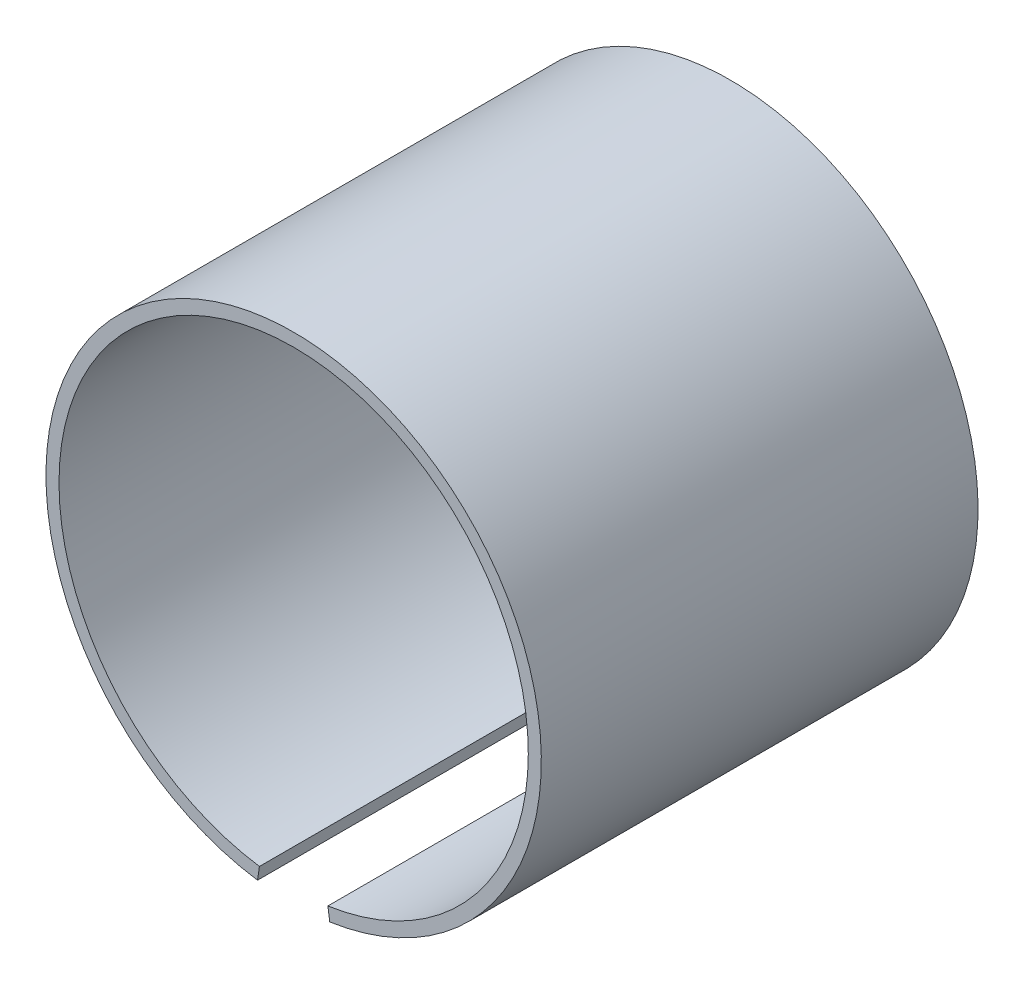
ISO-10303-21;
HEADER;
FILE_DESCRIPTION(('STEP AP214'),'2;1');
FILE_NAME('part.step','',(''),(''),'','','');
FILE_SCHEMA(('AUTOMOTIVE_DESIGN { 1 0 10303 214 1 1 1 1 }'));
ENDSEC;
DATA;
#1=APPLICATION_CONTEXT('core data for automotive mechanical design processes');
#2=APPLICATION_PROTOCOL_DEFINITION('international standard','automotive_design',2000,#1);
#3=PRODUCT_CONTEXT('',#1,'mechanical');
#4=PRODUCT('Part','Part','',(#3));
#5=PRODUCT_RELATED_PRODUCT_CATEGORY('part','',(#4));
#6=PRODUCT_DEFINITION_FORMATION('','',#4);
#7=PRODUCT_DEFINITION_CONTEXT('part definition',#1,'design');
#8=PRODUCT_DEFINITION('design','',#6,#7);
#9=PRODUCT_DEFINITION_SHAPE('','',#8);
#10=(LENGTH_UNIT() NAMED_UNIT(*) SI_UNIT(.MILLI.,.METRE.));
#11=(NAMED_UNIT(*) PLANE_ANGLE_UNIT() SI_UNIT($,.RADIAN.));
#12=(NAMED_UNIT(*) SI_UNIT($,.STERADIAN.) SOLID_ANGLE_UNIT());
#13=UNCERTAINTY_MEASURE_WITH_UNIT(LENGTH_MEASURE(1.E-05),#10,'distance_accuracy_value','');
#14=(GEOMETRIC_REPRESENTATION_CONTEXT(3) GLOBAL_UNCERTAINTY_ASSIGNED_CONTEXT((#13)) GLOBAL_UNIT_ASSIGNED_CONTEXT((#10,
#11,#12)) REPRESENTATION_CONTEXT('',''));
#15=CARTESIAN_POINT('',(0.,0.,0.));
#16=DIRECTION('',(0.,0.,1.));
#17=DIRECTION('',(1.,0.,0.));
#18=AXIS2_PLACEMENT_3D('',#15,#16,#17);
#19=CARTESIAN_POINT('',(-2.625,-17.8075651058757,-16.75));
#20=DIRECTION('',(-0.989309172548646,0.14583333333334,0.));
#21=DIRECTION('',(-0.14583333333334,-0.989309172548646,0.));
#22=AXIS2_PLACEMENT_3D('',#19,#20,#21);
#23=PLANE('',#22);
#24=DIRECTION('',(0.,0.,1.));
#25=VECTOR('',#24,1.);
#26=CARTESIAN_POINT('',(-2.77083333333334,-18.7968742784243,-16.75));
#27=LINE('',#26,#25);
#28=CARTESIAN_POINT('',(-2.77083333333334,-18.7968742784243,-16.75));
#29=VERTEX_POINT('',#28);
#30=CARTESIAN_POINT('',(-2.77083333333334,-18.7968742784243,16.75));
#31=VERTEX_POINT('',#30);
#32=EDGE_CURVE('E64',#29,#31,#27,.T.);
#33=ORIENTED_EDGE('',*,*,#32,.F.);
#34=DIRECTION('',(-0.14583333333334,-0.989309172548646,0.));
#35=VECTOR('',#34,1.);
#36=CARTESIAN_POINT('',(-2.625,-17.8075651058757,-16.75));
#37=LINE('',#36,#35);
#38=CARTESIAN_POINT('',(-2.625,-17.8075651058757,-16.75));
#39=VERTEX_POINT('',#38);
#40=EDGE_CURVE('E60',#39,#29,#37,.T.);
#41=ORIENTED_EDGE('',*,*,#40,.F.);
#42=DIRECTION('',(0.,0.,1.));
#43=VECTOR('',#42,1.);
#44=CARTESIAN_POINT('',(-2.625,-17.8075651058757,-16.75));
#45=LINE('',#44,#43);
#46=CARTESIAN_POINT('',(-2.625,-17.8075651058757,16.75));
#47=VERTEX_POINT('',#46);
#48=EDGE_CURVE('E67',#39,#47,#45,.T.);
#49=ORIENTED_EDGE('',*,*,#48,.T.);
#50=DIRECTION('',(-0.14583333333334,-0.989309172548646,0.));
#51=VECTOR('',#50,1.);
#52=CARTESIAN_POINT('',(-2.625,-17.8075651058757,16.75));
#53=LINE('',#52,#51);
#54=EDGE_CURVE('E73',#31,#47,#53,.F.);
#55=ORIENTED_EDGE('',*,*,#54,.F.);
#56=EDGE_LOOP('',(#33,#41,#49,#55));
#57=FACE_BOUND('',#56,.T.);
#58=ADVANCED_FACE('F17',(#57),#23,.F.);
#59=CARTESIAN_POINT('',(0.,0.,-16.75));
#60=DIRECTION('',(0.,0.,1.));
#61=DIRECTION('',(1.,0.,0.));
#62=AXIS2_PLACEMENT_3D('',#59,#60,#61);
#63=CYLINDRICAL_SURFACE('',#62,18.);
#64=ORIENTED_EDGE('',*,*,#48,.F.);
#65=CARTESIAN_POINT('',(0.,0.,-16.75));
#66=DIRECTION('',(0.,0.,1.));
#67=DIRECTION('',(1.,0.,0.));
#68=AXIS2_PLACEMENT_3D('',#65,#66,#67);
#69=CIRCLE('',#68,18.);
#70=CARTESIAN_POINT('',(2.625,-17.8075651058757,-16.75));
#71=VERTEX_POINT('',#70);
#72=EDGE_CURVE('E20',#71,#39,#69,.T.);
#73=ORIENTED_EDGE('',*,*,#72,.F.);
#74=DIRECTION('',(0.,0.,1.));
#75=VECTOR('',#74,1.);
#76=CARTESIAN_POINT('',(2.625,-17.8075651058757,-16.75));
#77=LINE('',#76,#75);
#78=CARTESIAN_POINT('',(2.625,-17.8075651058757,16.75));
#79=VERTEX_POINT('',#78);
#80=EDGE_CURVE('E72',#71,#79,#77,.T.);
#81=ORIENTED_EDGE('',*,*,#80,.T.);
#82=CARTESIAN_POINT('',(0.,0.,16.75));
#83=DIRECTION('',(0.,0.,1.));
#84=DIRECTION('',(1.,0.,0.));
#85=AXIS2_PLACEMENT_3D('',#82,#83,#84);
#86=CIRCLE('',#85,18.);
#87=EDGE_CURVE('E69',#79,#47,#86,.T.);
#88=ORIENTED_EDGE('',*,*,#87,.T.);
#89=EDGE_LOOP('',(#64,#73,#81,#88));
#90=FACE_BOUND('',#89,.T.);
#91=ADVANCED_FACE('F68',(#90),#63,.F.);
#92=CARTESIAN_POINT('',(2.77083333333333,-18.7968742784243,-16.75));
#93=DIRECTION('',(0.989309172548648,0.145833333333327,0.));
#94=DIRECTION('',(-0.145833333333327,0.989309172548648,0.));
#95=AXIS2_PLACEMENT_3D('',#92,#93,#94);
#96=PLANE('',#95);
#97=ORIENTED_EDGE('',*,*,#80,.F.);
#98=DIRECTION('',(-0.145833333333327,0.989309172548648,0.));
#99=VECTOR('',#98,1.);
#100=CARTESIAN_POINT('',(2.77083333333333,-18.7968742784243,-16.75));
#101=LINE('',#100,#99);
#102=CARTESIAN_POINT('',(2.77083333333333,-18.7968742784243,-16.75));
#103=VERTEX_POINT('',#102);
#104=EDGE_CURVE('E63',#103,#71,#101,.T.);
#105=ORIENTED_EDGE('',*,*,#104,.F.);
#106=DIRECTION('',(0.,0.,1.));
#107=VECTOR('',#106,1.);
#108=CARTESIAN_POINT('',(2.77083333333333,-18.7968742784243,-16.75));
#109=LINE('',#108,#107);
#110=CARTESIAN_POINT('',(2.77083333333333,-18.7968742784243,16.75));
#111=VERTEX_POINT('',#110);
#112=EDGE_CURVE('E80',#111,#103,#109,.F.);
#113=ORIENTED_EDGE('',*,*,#112,.F.);
#114=DIRECTION('',(-0.145833333333327,0.989309172548648,0.));
#115=VECTOR('',#114,1.);
#116=CARTESIAN_POINT('',(2.77083333333333,-18.7968742784243,16.75));
#117=LINE('',#116,#115);
#118=EDGE_CURVE('E83',#111,#79,#117,.T.);
#119=ORIENTED_EDGE('',*,*,#118,.T.);
#120=EDGE_LOOP('',(#97,#105,#113,#119));
#121=FACE_BOUND('',#120,.T.);
#122=ADVANCED_FACE('F88',(#121),#96,.F.);
#123=CARTESIAN_POINT('',(0.,0.,-16.75));
#124=DIRECTION('',(0.,0.,-1.));
#125=DIRECTION('',(-1.,0.,0.));
#126=AXIS2_PLACEMENT_3D('',#123,#124,#125);
#127=PLANE('',#126);
#128=ORIENTED_EDGE('',*,*,#104,.T.);
#129=ORIENTED_EDGE('',*,*,#72,.T.);
#130=ORIENTED_EDGE('',*,*,#40,.T.);
#131=CARTESIAN_POINT('',(0.,0.,-16.75));
#132=DIRECTION('',(0.,0.,1.));
#133=DIRECTION('',(1.,0.,0.));
#134=AXIS2_PLACEMENT_3D('',#131,#132,#133);
#135=CIRCLE('',#134,19.);
#136=EDGE_CURVE('E26',#103,#29,#135,.T.);
#137=ORIENTED_EDGE('',*,*,#136,.F.);
#138=EDGE_LOOP('',(#128,#129,#130,#137));
#139=FACE_BOUND('',#138,.T.);
#140=ADVANCED_FACE('F58',(#139),#127,.T.);
#141=CARTESIAN_POINT('',(0.,0.,16.75));
#142=DIRECTION('',(0.,0.,-1.));
#143=DIRECTION('',(-1.,0.,0.));
#144=AXIS2_PLACEMENT_3D('',#141,#142,#143);
#145=PLANE('',#144);
#146=ORIENTED_EDGE('',*,*,#87,.F.);
#147=ORIENTED_EDGE('',*,*,#118,.F.);
#148=CARTESIAN_POINT('',(0.,0.,16.75));
#149=DIRECTION('',(0.,0.,1.));
#150=DIRECTION('',(1.,0.,0.));
#151=AXIS2_PLACEMENT_3D('',#148,#149,#150);
#152=CIRCLE('',#151,19.);
#153=EDGE_CURVE('E11',#31,#111,#152,.F.);
#154=ORIENTED_EDGE('',*,*,#153,.F.);
#155=ORIENTED_EDGE('',*,*,#54,.T.);
#156=EDGE_LOOP('',(#146,#147,#154,#155));
#157=FACE_BOUND('',#156,.T.);
#158=ADVANCED_FACE('F90',(#157),#145,.F.);
#159=CARTESIAN_POINT('',(0.,0.,-16.75));
#160=DIRECTION('',(0.,0.,1.));
#161=DIRECTION('',(1.,0.,0.));
#162=AXIS2_PLACEMENT_3D('',#159,#160,#161);
#163=CYLINDRICAL_SURFACE('',#162,19.);
#164=ORIENTED_EDGE('',*,*,#153,.T.);
#165=ORIENTED_EDGE('',*,*,#112,.T.);
#166=ORIENTED_EDGE('',*,*,#136,.T.);
#167=ORIENTED_EDGE('',*,*,#32,.T.);
#168=EDGE_LOOP('',(#164,#165,#166,#167));
#169=FACE_BOUND('',#168,.T.);
#170=ADVANCED_FACE('F91',(#169),#163,.T.);
#171=CLOSED_SHELL('',(#58,#91,#122,#140,#158,#170));
#172=MANIFOLD_SOLID_BREP('B1',#171);
#173=ADVANCED_BREP_SHAPE_REPRESENTATION('',(#18,#172),#14);
#174=SHAPE_DEFINITION_REPRESENTATION(#9,#173);
ENDSEC;
END-ISO-10303-21;
